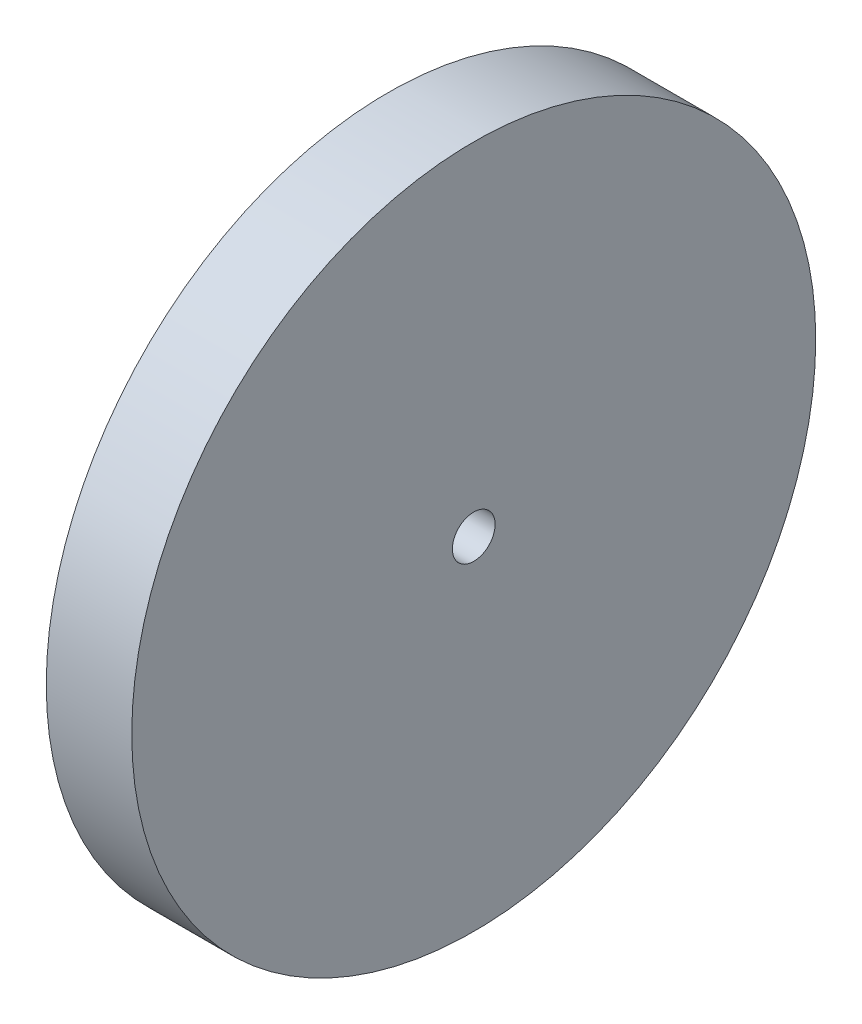
ISO-10303-21;
HEADER;
FILE_DESCRIPTION(('STEP AP214'),'2;1');
FILE_NAME('part.step','',(''),(''),'','','');
FILE_SCHEMA(('AUTOMOTIVE_DESIGN { 1 0 10303 214 1 1 1 1 }'));
ENDSEC;
DATA;
#1=APPLICATION_CONTEXT('core data for automotive mechanical design processes');
#2=APPLICATION_PROTOCOL_DEFINITION('international standard','automotive_design',2000,#1);
#3=PRODUCT_CONTEXT('',#1,'mechanical');
#4=PRODUCT('Part','Part','',(#3));
#5=PRODUCT_RELATED_PRODUCT_CATEGORY('part','',(#4));
#6=PRODUCT_DEFINITION_FORMATION('','',#4);
#7=PRODUCT_DEFINITION_CONTEXT('part definition',#1,'design');
#8=PRODUCT_DEFINITION('design','',#6,#7);
#9=PRODUCT_DEFINITION_SHAPE('','',#8);
#10=(LENGTH_UNIT() NAMED_UNIT(*) SI_UNIT(.MILLI.,.METRE.));
#11=(NAMED_UNIT(*) PLANE_ANGLE_UNIT() SI_UNIT($,.RADIAN.));
#12=(NAMED_UNIT(*) SI_UNIT($,.STERADIAN.) SOLID_ANGLE_UNIT());
#13=UNCERTAINTY_MEASURE_WITH_UNIT(LENGTH_MEASURE(1.E-05),#10,'distance_accuracy_value','');
#14=(GEOMETRIC_REPRESENTATION_CONTEXT(3) GLOBAL_UNCERTAINTY_ASSIGNED_CONTEXT((#13)) GLOBAL_UNIT_ASSIGNED_CONTEXT((#10,
#11,#12)) REPRESENTATION_CONTEXT('',''));
#15=CARTESIAN_POINT('',(0.,0.,0.));
#16=DIRECTION('',(0.,0.,1.));
#17=DIRECTION('',(1.,0.,0.));
#18=AXIS2_PLACEMENT_3D('',#15,#16,#17);
#19=CARTESIAN_POINT('',(0.,0.,0.));
#20=DIRECTION('',(-0.999999999999737,0.,-7.25905194872075E-07));
#21=DIRECTION('',(-7.25905194872075E-07,0.,0.999999999999737));
#22=AXIS2_PLACEMENT_3D('',#19,#20,#21);
#23=CONICAL_SURFACE('',#22,0.,1.5707956008897);
#24=CARTESIAN_POINT('',(-1.72856174189545E-06,0.,-1.25477194730912E-12));
#25=DIRECTION('',(-0.999999999999737,0.,-7.25905194872075E-07));
#26=DIRECTION('',(-7.25905194872075E-07,0.,0.999999999999737));
#27=AXIS2_PLACEMENT_3D('',#24,#25,#26);
#28=CIRCLE('',#27,2.38125);
#29=CARTESIAN_POINT('',(-3.45712348718457E-06,0.,2.38124999999812));
#30=VERTEX_POINT('',#29);
#31=EDGE_CURVE('E56',#30,#30,#28,.T.);
#32=ORIENTED_EDGE('',*,*,#31,.T.);
#33=EDGE_LOOP('',(#32));
#34=FACE_BOUND('',#33,.T.);
#35=CARTESIAN_POINT('',(-2.76569879220645E-05,0.,-2.00763512063435E-11));
#36=DIRECTION('',(-0.999999999999737,0.,-7.25905194872075E-07));
#37=DIRECTION('',(-7.25905194872075E-07,0.,0.999999999999737));
#38=AXIS2_PLACEMENT_3D('',#35,#36,#37);
#39=CIRCLE('',#38,38.09999999999);
#40=CARTESIAN_POINT('',(-5.53139758466833E-05,0.,38.0999999999599));
#41=VERTEX_POINT('',#40);
#42=EDGE_CURVE('E10',#41,#41,#39,.T.);
#43=ORIENTED_EDGE('',*,*,#42,.F.);
#44=EDGE_LOOP('',(#43));
#45=FACE_BOUND('',#44,.T.);
#46=ADVANCED_FACE('F31',(#34,#45),#23,.T.);
#47=CARTESIAN_POINT('',(-9.66414804864275,0.,-7.01525527252445E-06));
#48=DIRECTION('',(-0.999999999999737,0.,-7.25905194872075E-07));
#49=DIRECTION('',(-7.25905194872075E-07,0.,0.999999999999737));
#50=AXIS2_PLACEMENT_3D('',#47,#48,#49);
#51=CYLINDRICAL_SURFACE('',#50,38.0999965428665);
#52=CARTESIAN_POINT('',(-9.5250276569829,0.,-6.9142670575059E-06));
#53=DIRECTION('',(-0.999999999999737,0.,-7.25905194872075E-07));
#54=DIRECTION('',(-7.25905194872075E-07,0.,0.999999999999737));
#55=AXIS2_PLACEMENT_3D('',#52,#53,#54);
#56=CIRCLE('',#55,38.099993085743);
#57=CARTESIAN_POINT('',(-9.52505531396581,0.,38.0999861714659));
#58=VERTEX_POINT('',#57);
#59=EDGE_CURVE('E37',#58,#58,#56,.T.);
#60=ORIENTED_EDGE('',*,*,#59,.F.);
#61=EDGE_LOOP('',(#60));
#62=FACE_BOUND('',#61,.T.);
#63=ORIENTED_EDGE('',*,*,#42,.T.);
#64=EDGE_LOOP('',(#63));
#65=FACE_BOUND('',#64,.T.);
#66=ADVANCED_FACE('F92',(#62,#65),#51,.T.);
#67=CARTESIAN_POINT('',(-9.52499654287651,0.,-38.0999999999975));
#68=DIRECTION('',(0.999999999999737,0.,7.25905194872075E-07));
#69=DIRECTION('',(7.25905194872075E-07,0.,-0.999999999999737));
#70=AXIS2_PLACEMENT_3D('',#67,#68,#69);
#71=PLANE('',#70);
#72=CARTESIAN_POINT('',(-9.52502074273592,0.,-6.91426203841809E-06));
#73=DIRECTION('',(-0.999999999999737,0.,-7.25905194872075E-07));
#74=DIRECTION('',(-7.25905194872075E-07,0.,0.999999999999737));
#75=AXIS2_PLACEMENT_3D('',#72,#73,#74);
#76=CIRCLE('',#75,28.5749930857455);
#77=CARTESIAN_POINT('',(-9.52504148547185,0.,28.5749861714759));
#78=VERTEX_POINT('',#77);
#79=EDGE_CURVE('E41',#78,#78,#76,.T.);
#80=ORIENTED_EDGE('',*,*,#79,.F.);
#81=EDGE_LOOP('',(#80));
#82=FACE_BOUND('',#81,.T.);
#83=ORIENTED_EDGE('',*,*,#59,.T.);
#84=EDGE_LOOP('',(#83));
#85=FACE_BOUND('',#84,.T.);
#86=ADVANCED_FACE('F87',(#82,#85),#71,.F.);
#87=CARTESIAN_POINT('',(-9.66414804864275,0.,-7.01525527252445E-06));
#88=DIRECTION('',(-0.999999999999737,0.,-7.25905194872075E-07));
#89=DIRECTION('',(-7.25905194872075E-07,0.,0.999999999999737));
#90=AXIS2_PLACEMENT_3D('',#87,#88,#89);
#91=CYLINDRICAL_SURFACE('',#90,28.5749953399878);
#92=CARTESIAN_POINT('',(-3.31417580663723,0.,-2.40577743475794E-06));
#93=DIRECTION('',(-0.999999999999737,0.,-7.25905194872075E-07));
#94=DIRECTION('',(-7.25905194872075E-07,0.,0.999999999999737));
#95=AXIS2_PLACEMENT_3D('',#92,#93,#94);
#96=CIRCLE('',#95,28.5749975942301);
#97=CARTESIAN_POINT('',(-3.31419654937642,0.,28.5749951884451));
#98=VERTEX_POINT('',#97);
#99=EDGE_CURVE('E45',#98,#98,#96,.T.);
#100=ORIENTED_EDGE('',*,*,#99,.F.);
#101=EDGE_LOOP('',(#100));
#102=FACE_BOUND('',#101,.T.);
#103=ORIENTED_EDGE('',*,*,#79,.T.);
#104=EDGE_LOOP('',(#103));
#105=FACE_BOUND('',#104,.T.);
#106=ADVANCED_FACE('F81',(#102,#105),#91,.F.);
#107=CARTESIAN_POINT('',(-3.31415045440004,0.,-28.5749999999967));
#108=DIRECTION('',(0.999999999999737,0.,7.25905194872075E-07));
#109=DIRECTION('',(7.25905194872075E-07,0.,-0.999999999999737));
#110=AXIS2_PLACEMENT_3D('',#107,#108,#109);
#111=PLANE('',#110);
#112=CARTESIAN_POINT('',(-3.31416658764125,0.,-2.40577074264087E-06));
#113=DIRECTION('',(-0.999999999999737,0.,-7.25905194872075E-07));
#114=DIRECTION('',(-7.25905194872075E-07,0.,0.999999999999737));
#115=AXIS2_PLACEMENT_3D('',#112,#113,#114);
#116=CIRCLE('',#115,15.8749975942334);
#117=CARTESIAN_POINT('',(-3.31417811138447,0.,15.8749951884585));
#118=VERTEX_POINT('',#117);
#119=EDGE_CURVE('E50',#118,#118,#116,.T.);
#120=ORIENTED_EDGE('',*,*,#119,.F.);
#121=EDGE_LOOP('',(#120));
#122=FACE_BOUND('',#121,.T.);
#123=ORIENTED_EDGE('',*,*,#99,.T.);
#124=EDGE_LOOP('',(#123));
#125=FACE_BOUND('',#124,.T.);
#126=ADVANCED_FACE('F75',(#122,#125),#111,.F.);
#127=CARTESIAN_POINT('',(-3.31416658764125,0.,-2.40577074264087E-06));
#128=DIRECTION('',(0.999999999999737,0.,7.25905194872075E-07));
#129=DIRECTION('',(7.25905194872075E-07,0.,-0.999999999999737));
#130=AXIS2_PLACEMENT_3D('',#127,#128,#129);
#131=CONICAL_SURFACE('',#130,15.8749975942334,0.785398889302643);
#132=CARTESIAN_POINT('',(-9.66415496288973,0.,-7.01526029161225E-06));
#133=DIRECTION('',(-0.999999999999737,0.,-7.25905194872075E-07));
#134=DIRECTION('',(-7.25905194872075E-07,0.,0.999999999999737));
#135=AXIS2_PLACEMENT_3D('',#132,#133,#134);
#136=CIRCLE('',#135,9.52499999999749);
#137=CARTESIAN_POINT('',(-9.66416187713672,0.,9.52499298473469));
#138=VERTEX_POINT('',#137);
#139=EDGE_CURVE('E53',#138,#138,#136,.T.);
#140=ORIENTED_EDGE('',*,*,#139,.F.);
#141=EDGE_LOOP('',(#140));
#142=FACE_BOUND('',#141,.T.);
#143=ORIENTED_EDGE('',*,*,#119,.T.);
#144=EDGE_LOOP('',(#143));
#145=FACE_BOUND('',#144,.T.);
#146=ADVANCED_FACE('F69',(#142,#145),#131,.T.);
#147=CARTESIAN_POINT('',(-9.66414459151926,0.,-9.52500701525276));
#148=DIRECTION('',(0.999999999999737,0.,7.25905194872075E-07));
#149=DIRECTION('',(7.25905194872075E-07,0.,-0.999999999999737));
#150=AXIS2_PLACEMENT_3D('',#147,#148,#149);
#151=PLANE('',#150);
#152=CARTESIAN_POINT('',(-9.66415150576625,0.,-7.01525778206835E-06));
#153=DIRECTION('',(-0.999999999999737,0.,-7.25905194872075E-07));
#154=DIRECTION('',(-7.25905194872075E-07,0.,0.999999999999737));
#155=AXIS2_PLACEMENT_3D('',#152,#153,#154);
#156=CIRCLE('',#155,2.38125);
#157=CARTESIAN_POINT('',(-9.664153234328,0.,2.38124298474159));
#158=VERTEX_POINT('',#157);
#159=EDGE_CURVE('E59',#158,#158,#156,.T.);
#160=ORIENTED_EDGE('',*,*,#159,.F.);
#161=EDGE_LOOP('',(#160));
#162=FACE_BOUND('',#161,.T.);
#163=ORIENTED_EDGE('',*,*,#139,.T.);
#164=EDGE_LOOP('',(#163));
#165=FACE_BOUND('',#164,.T.);
#166=ADVANCED_FACE('F66',(#162,#165),#151,.F.);
#167=CARTESIAN_POINT('',(2.76569879290034E-05,0.,2.00763512121338E-11));
#168=DIRECTION('',(-0.999999999999736,0.,-7.25905194872075E-07));
#169=DIRECTION('',(-7.25905194872075E-07,0.,0.999999999999737));
#170=AXIS2_PLACEMENT_3D('',#167,#168,#169);
#171=CYLINDRICAL_SURFACE('',#170,2.38125);
#172=ORIENTED_EDGE('',*,*,#159,.T.);
#173=EDGE_LOOP('',(#172));
#174=FACE_BOUND('',#173,.T.);
#175=ORIENTED_EDGE('',*,*,#31,.F.);
#176=EDGE_LOOP('',(#175));
#177=FACE_BOUND('',#176,.T.);
#178=ADVANCED_FACE('F63',(#174,#177),#171,.F.);
#179=CLOSED_SHELL('',(#46,#66,#86,#106,#126,#146,#166,#178));
#180=MANIFOLD_SOLID_BREP('B2',#179);
#181=ADVANCED_BREP_SHAPE_REPRESENTATION('',(#18,#180),#14);
#182=SHAPE_DEFINITION_REPRESENTATION(#9,#181);
ENDSEC;
END-ISO-10303-21;
